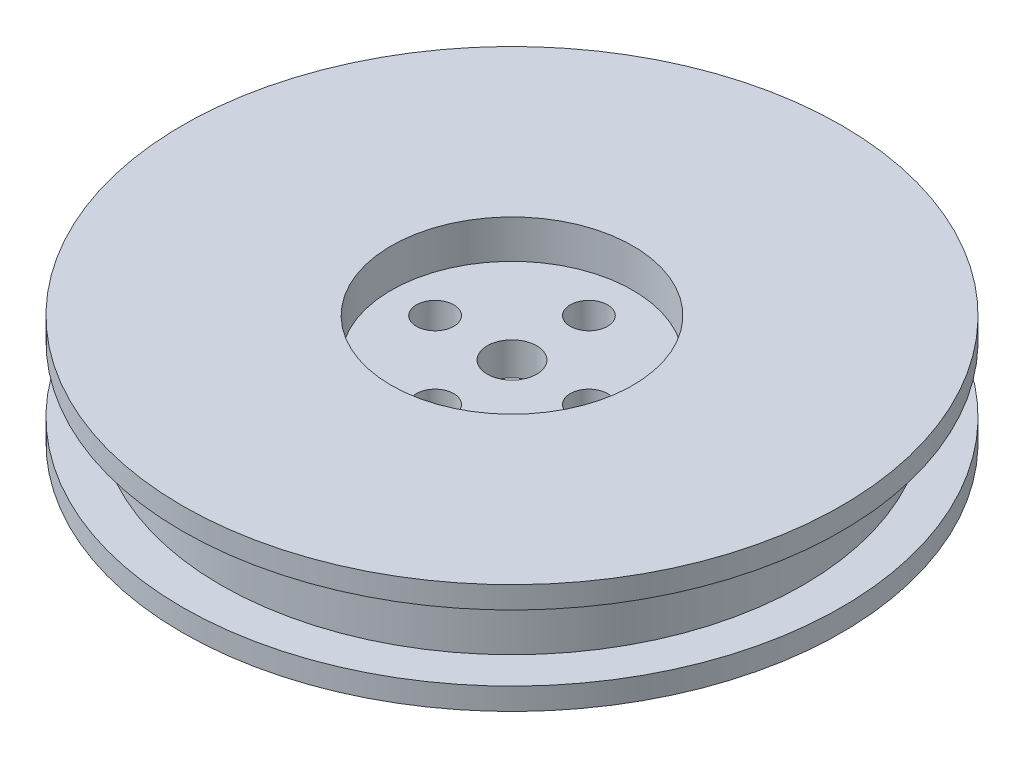
ISO-10303-21;
HEADER;
FILE_DESCRIPTION(('STEP AP214'),'2;1');
FILE_NAME('part.step','',(''),(''),'','','');
FILE_SCHEMA(('AUTOMOTIVE_DESIGN { 1 0 10303 214 1 1 1 1 }'));
ENDSEC;
DATA;
#1=APPLICATION_CONTEXT('core data for automotive mechanical design processes');
#2=APPLICATION_PROTOCOL_DEFINITION('international standard','automotive_design',2000,#1);
#3=PRODUCT_CONTEXT('',#1,'mechanical');
#4=PRODUCT('Part','Part','',(#3));
#5=PRODUCT_RELATED_PRODUCT_CATEGORY('part','',(#4));
#6=PRODUCT_DEFINITION_FORMATION('','',#4);
#7=PRODUCT_DEFINITION_CONTEXT('part definition',#1,'design');
#8=PRODUCT_DEFINITION('design','',#6,#7);
#9=PRODUCT_DEFINITION_SHAPE('','',#8);
#10=(LENGTH_UNIT() NAMED_UNIT(*) SI_UNIT(.MILLI.,.METRE.));
#11=(NAMED_UNIT(*) PLANE_ANGLE_UNIT() SI_UNIT($,.RADIAN.));
#12=(NAMED_UNIT(*) SI_UNIT($,.STERADIAN.) SOLID_ANGLE_UNIT());
#13=UNCERTAINTY_MEASURE_WITH_UNIT(LENGTH_MEASURE(1.E-05),#10,'distance_accuracy_value','');
#14=(GEOMETRIC_REPRESENTATION_CONTEXT(3) GLOBAL_UNCERTAINTY_ASSIGNED_CONTEXT((#13)) GLOBAL_UNIT_ASSIGNED_CONTEXT((#10,
#11,#12)) REPRESENTATION_CONTEXT('',''));
#15=CARTESIAN_POINT('',(0.,0.,0.));
#16=DIRECTION('',(0.,0.,1.));
#17=DIRECTION('',(1.,0.,0.));
#18=AXIS2_PLACEMENT_3D('',#15,#16,#17);
#19=CARTESIAN_POINT('',(0.,2.,0.));
#20=DIRECTION('',(0.,-1.,0.));
#21=DIRECTION('',(0.,0.,-1.));
#22=AXIS2_PLACEMENT_3D('',#19,#20,#21);
#23=CYLINDRICAL_SURFACE('',#22,30.);
#24=CARTESIAN_POINT('',(0.,2.,0.));
#25=DIRECTION('',(0.,1.,0.));
#26=DIRECTION('',(0.,0.,1.));
#27=AXIS2_PLACEMENT_3D('',#24,#25,#26);
#28=CIRCLE('',#27,30.);
#29=CARTESIAN_POINT('',(0.,2.,30.));
#30=VERTEX_POINT('',#29);
#31=EDGE_CURVE('E38',#30,#30,#28,.T.);
#32=ORIENTED_EDGE('',*,*,#31,.F.);
#33=EDGE_LOOP('',(#32));
#34=FACE_BOUND('',#33,.T.);
#35=CARTESIAN_POINT('',(0.,0.,0.));
#36=DIRECTION('',(0.,1.,0.));
#37=DIRECTION('',(0.,0.,1.));
#38=AXIS2_PLACEMENT_3D('',#35,#36,#37);
#39=CIRCLE('',#38,30.);
#40=CARTESIAN_POINT('',(0.,0.,30.));
#41=VERTEX_POINT('',#40);
#42=EDGE_CURVE('E43',#41,#41,#39,.T.);
#43=ORIENTED_EDGE('',*,*,#42,.T.);
#44=EDGE_LOOP('',(#43));
#45=FACE_BOUND('',#44,.T.);
#46=ADVANCED_FACE('F31',(#34,#45),#23,.T.);
#47=CARTESIAN_POINT('',(0.,2.,0.));
#48=DIRECTION('',(0.,1.,0.));
#49=DIRECTION('',(0.,0.,1.));
#50=AXIS2_PLACEMENT_3D('',#47,#48,#49);
#51=PLANE('',#50);
#52=CARTESIAN_POINT('',(0.,2.,0.));
#53=DIRECTION('',(0.,1.,0.));
#54=DIRECTION('',(0.,0.,1.));
#55=AXIS2_PLACEMENT_3D('',#52,#53,#54);
#56=CIRCLE('',#55,26.5);
#57=CARTESIAN_POINT('',(0.,2.,26.5));
#58=VERTEX_POINT('',#57);
#59=EDGE_CURVE('E10',#58,#58,#56,.T.);
#60=ORIENTED_EDGE('',*,*,#59,.F.);
#61=EDGE_LOOP('',(#60));
#62=FACE_BOUND('',#61,.T.);
#63=ORIENTED_EDGE('',*,*,#31,.T.);
#64=EDGE_LOOP('',(#63));
#65=FACE_BOUND('',#64,.T.);
#66=ADVANCED_FACE('F142',(#62,#65),#51,.T.);
#67=CARTESIAN_POINT('',(0.,0.,0.));
#68=DIRECTION('',(0.,1.,0.));
#69=DIRECTION('',(0.,0.,1.));
#70=AXIS2_PLACEMENT_3D('',#67,#68,#69);
#71=PLANE('',#70);
#72=CARTESIAN_POINT('',(0.,0.,0.));
#73=DIRECTION('',(0.,-1.,0.));
#74=DIRECTION('',(0.,0.,-1.));
#75=AXIS2_PLACEMENT_3D('',#72,#73,#74);
#76=CIRCLE('',#75,11.);
#77=CARTESIAN_POINT('',(0.,0.,-11.));
#78=VERTEX_POINT('',#77);
#79=EDGE_CURVE('E63',#78,#78,#76,.T.);
#80=ORIENTED_EDGE('',*,*,#79,.F.);
#81=EDGE_LOOP('',(#80));
#82=FACE_BOUND('',#81,.T.);
#83=ORIENTED_EDGE('',*,*,#42,.F.);
#84=EDGE_LOOP('',(#83));
#85=FACE_BOUND('',#84,.T.);
#86=ADVANCED_FACE('F147',(#82,#85),#71,.F.);
#87=CARTESIAN_POINT('',(0.,8.,0.));
#88=DIRECTION('',(0.,-1.,0.));
#89=DIRECTION('',(0.,0.,-1.));
#90=AXIS2_PLACEMENT_3D('',#87,#88,#89);
#91=CYLINDRICAL_SURFACE('',#90,26.5);
#92=CARTESIAN_POINT('',(0.,8.,0.));
#93=DIRECTION('',(0.,1.,0.));
#94=DIRECTION('',(0.,0.,1.));
#95=AXIS2_PLACEMENT_3D('',#92,#93,#94);
#96=CIRCLE('',#95,26.5);
#97=CARTESIAN_POINT('',(0.,8.,26.5));
#98=VERTEX_POINT('',#97);
#99=EDGE_CURVE('E46',#98,#98,#96,.T.);
#100=ORIENTED_EDGE('',*,*,#99,.F.);
#101=EDGE_LOOP('',(#100));
#102=FACE_BOUND('',#101,.T.);
#103=ORIENTED_EDGE('',*,*,#59,.T.);
#104=EDGE_LOOP('',(#103));
#105=FACE_BOUND('',#104,.T.);
#106=ADVANCED_FACE('F137',(#102,#105),#91,.T.);
#107=CARTESIAN_POINT('',(0.,10.,0.));
#108=DIRECTION('',(0.,-1.,0.));
#109=DIRECTION('',(0.,0.,-1.));
#110=AXIS2_PLACEMENT_3D('',#107,#108,#109);
#111=CYLINDRICAL_SURFACE('',#110,30.);
#112=CARTESIAN_POINT('',(0.,10.,0.));
#113=DIRECTION('',(0.,1.,0.));
#114=DIRECTION('',(0.,0.,1.));
#115=AXIS2_PLACEMENT_3D('',#112,#113,#114);
#116=CIRCLE('',#115,30.);
#117=CARTESIAN_POINT('',(0.,10.,30.));
#118=VERTEX_POINT('',#117);
#119=EDGE_CURVE('E52',#118,#118,#116,.T.);
#120=ORIENTED_EDGE('',*,*,#119,.F.);
#121=EDGE_LOOP('',(#120));
#122=FACE_BOUND('',#121,.T.);
#123=CARTESIAN_POINT('',(0.,8.,0.));
#124=DIRECTION('',(0.,1.,0.));
#125=DIRECTION('',(0.,0.,1.));
#126=AXIS2_PLACEMENT_3D('',#123,#124,#125);
#127=CIRCLE('',#126,30.);
#128=CARTESIAN_POINT('',(0.,8.,30.));
#129=VERTEX_POINT('',#128);
#130=EDGE_CURVE('E56',#129,#129,#127,.T.);
#131=ORIENTED_EDGE('',*,*,#130,.T.);
#132=EDGE_LOOP('',(#131));
#133=FACE_BOUND('',#132,.T.);
#134=ADVANCED_FACE('F129',(#122,#133),#111,.T.);
#135=CARTESIAN_POINT('',(0.,10.,0.));
#136=DIRECTION('',(0.,1.,0.));
#137=DIRECTION('',(0.,0.,1.));
#138=AXIS2_PLACEMENT_3D('',#135,#136,#137);
#139=PLANE('',#138);
#140=CARTESIAN_POINT('',(0.,10.,0.));
#141=DIRECTION('',(0.,1.,0.));
#142=DIRECTION('',(0.,0.,1.));
#143=AXIS2_PLACEMENT_3D('',#140,#141,#142);
#144=CIRCLE('',#143,11.);
#145=CARTESIAN_POINT('',(0.,10.,11.));
#146=VERTEX_POINT('',#145);
#147=EDGE_CURVE('E69',#146,#146,#144,.T.);
#148=ORIENTED_EDGE('',*,*,#147,.F.);
#149=EDGE_LOOP('',(#148));
#150=FACE_BOUND('',#149,.T.);
#151=ORIENTED_EDGE('',*,*,#119,.T.);
#152=EDGE_LOOP('',(#151));
#153=FACE_BOUND('',#152,.T.);
#154=ADVANCED_FACE('F126',(#150,#153),#139,.T.);
#155=CARTESIAN_POINT('',(0.,8.,0.));
#156=DIRECTION('',(0.,1.,0.));
#157=DIRECTION('',(0.,0.,1.));
#158=AXIS2_PLACEMENT_3D('',#155,#156,#157);
#159=PLANE('',#158);
#160=ORIENTED_EDGE('',*,*,#99,.T.);
#161=EDGE_LOOP('',(#160));
#162=FACE_BOUND('',#161,.T.);
#163=ORIENTED_EDGE('',*,*,#130,.F.);
#164=EDGE_LOOP('',(#163));
#165=FACE_BOUND('',#164,.T.);
#166=ADVANCED_FACE('F128',(#162,#165),#159,.F.);
#167=CARTESIAN_POINT('',(0.,3.5,0.));
#168=DIRECTION('',(0.,-1.,0.));
#169=DIRECTION('',(0.,0.,-1.));
#170=AXIS2_PLACEMENT_3D('',#167,#168,#169);
#171=CYLINDRICAL_SURFACE('',#170,11.);
#172=CARTESIAN_POINT('',(0.,3.5,0.));
#173=DIRECTION('',(0.,-1.,0.));
#174=DIRECTION('',(0.,0.,-1.));
#175=AXIS2_PLACEMENT_3D('',#172,#173,#174);
#176=CIRCLE('',#175,11.);
#177=CARTESIAN_POINT('',(0.,3.5,-11.));
#178=VERTEX_POINT('',#177);
#179=EDGE_CURVE('E61',#178,#178,#176,.T.);
#180=ORIENTED_EDGE('',*,*,#179,.F.);
#181=EDGE_LOOP('',(#180));
#182=FACE_BOUND('',#181,.T.);
#183=ORIENTED_EDGE('',*,*,#79,.T.);
#184=EDGE_LOOP('',(#183));
#185=FACE_BOUND('',#184,.T.);
#186=ADVANCED_FACE('F135',(#182,#185),#171,.F.);
#187=CARTESIAN_POINT('',(0.,3.5,0.));
#188=DIRECTION('',(0.,-1.,0.));
#189=DIRECTION('',(0.,0.,-1.));
#190=AXIS2_PLACEMENT_3D('',#187,#188,#189);
#191=PLANE('',#190);
#192=CARTESIAN_POINT('',(0.,3.5,-7.));
#193=DIRECTION('',(0.,-1.,0.));
#194=DIRECTION('',(0.,0.,-1.));
#195=AXIS2_PLACEMENT_3D('',#192,#193,#194);
#196=CIRCLE('',#195,1.7);
#197=CARTESIAN_POINT('',(0.,3.5,-8.7));
#198=VERTEX_POINT('',#197);
#199=EDGE_CURVE('E77',#198,#198,#196,.T.);
#200=ORIENTED_EDGE('',*,*,#199,.F.);
#201=EDGE_LOOP('',(#200));
#202=FACE_BOUND('',#201,.T.);
#203=CARTESIAN_POINT('',(7.0000000000002,3.5,-1.98094713253425E-13));
#204=DIRECTION('',(0.,-1.,0.));
#205=DIRECTION('',(0.,0.,-1.));
#206=AXIS2_PLACEMENT_3D('',#203,#204,#205);
#207=CIRCLE('',#206,1.70000000000015);
#208=CARTESIAN_POINT('',(7.0000000000002,3.5,-1.70000000000035));
#209=VERTEX_POINT('',#208);
#210=EDGE_CURVE('E80',#209,#209,#207,.T.);
#211=ORIENTED_EDGE('',*,*,#210,.F.);
#212=EDGE_LOOP('',(#211));
#213=FACE_BOUND('',#212,.T.);
#214=CARTESIAN_POINT('',(3.9618942650685E-13,3.5,7.));
#215=DIRECTION('',(0.,-1.,0.));
#216=DIRECTION('',(0.,0.,-1.));
#217=AXIS2_PLACEMENT_3D('',#214,#215,#216);
#218=CIRCLE('',#217,1.70000000000043);
#219=CARTESIAN_POINT('',(3.9618942650685E-13,3.5,5.29999999999958));
#220=VERTEX_POINT('',#219);
#221=EDGE_CURVE('E83',#220,#220,#218,.T.);
#222=ORIENTED_EDGE('',*,*,#221,.F.);
#223=EDGE_LOOP('',(#222));
#224=FACE_BOUND('',#223,.T.);
#225=CARTESIAN_POINT('',(-6.9999999999998,3.5,1.98951966012828E-13));
#226=DIRECTION('',(0.,-1.,0.));
#227=DIRECTION('',(0.,0.,-1.));
#228=AXIS2_PLACEMENT_3D('',#225,#226,#227);
#229=CIRCLE('',#228,1.70000000000032);
#230=CARTESIAN_POINT('',(-6.9999999999998,3.5,-1.70000000000012));
#231=VERTEX_POINT('',#230);
#232=EDGE_CURVE('E86',#231,#231,#229,.T.);
#233=ORIENTED_EDGE('',*,*,#232,.F.);
#234=EDGE_LOOP('',(#233));
#235=FACE_BOUND('',#234,.T.);
#236=CARTESIAN_POINT('',(0.,3.5,0.));
#237=DIRECTION('',(0.,-1.,0.));
#238=DIRECTION('',(0.,0.,-1.));
#239=AXIS2_PLACEMENT_3D('',#236,#237,#238);
#240=CIRCLE('',#239,2.25);
#241=CARTESIAN_POINT('',(0.,3.5,-2.25));
#242=VERTEX_POINT('',#241);
#243=EDGE_CURVE('E34',#242,#242,#240,.T.);
#244=ORIENTED_EDGE('',*,*,#243,.F.);
#245=EDGE_LOOP('',(#244));
#246=FACE_BOUND('',#245,.T.);
#247=ORIENTED_EDGE('',*,*,#179,.T.);
#248=EDGE_LOOP('',(#247));
#249=FACE_BOUND('',#248,.T.);
#250=ADVANCED_FACE('F122',(#202,#213,#224,#235,#246,#249),#191,.T.);
#251=CARTESIAN_POINT('',(0.,6.5,0.));
#252=DIRECTION('',(0.,1.,0.));
#253=DIRECTION('',(0.,0.,1.));
#254=AXIS2_PLACEMENT_3D('',#251,#252,#253);
#255=CYLINDRICAL_SURFACE('',#254,11.);
#256=CARTESIAN_POINT('',(0.,6.5,0.));
#257=DIRECTION('',(0.,1.,0.));
#258=DIRECTION('',(0.,0.,1.));
#259=AXIS2_PLACEMENT_3D('',#256,#257,#258);
#260=CIRCLE('',#259,11.);
#261=CARTESIAN_POINT('',(0.,6.5,11.));
#262=VERTEX_POINT('',#261);
#263=EDGE_CURVE('E66',#262,#262,#260,.T.);
#264=ORIENTED_EDGE('',*,*,#263,.F.);
#265=EDGE_LOOP('',(#264));
#266=FACE_BOUND('',#265,.T.);
#267=ORIENTED_EDGE('',*,*,#147,.T.);
#268=EDGE_LOOP('',(#267));
#269=FACE_BOUND('',#268,.T.);
#270=ADVANCED_FACE('F108',(#266,#269),#255,.F.);
#271=CARTESIAN_POINT('',(0.,6.5,0.));
#272=DIRECTION('',(0.,1.,0.));
#273=DIRECTION('',(0.,0.,1.));
#274=AXIS2_PLACEMENT_3D('',#271,#272,#273);
#275=PLANE('',#274);
#276=CARTESIAN_POINT('',(0.,6.5,-7.));
#277=DIRECTION('',(0.,1.,0.));
#278=DIRECTION('',(0.,0.,1.));
#279=AXIS2_PLACEMENT_3D('',#276,#277,#278);
#280=CIRCLE('',#279,1.7);
#281=CARTESIAN_POINT('',(0.,6.5,-5.3));
#282=VERTEX_POINT('',#281);
#283=EDGE_CURVE('E89',#282,#282,#280,.T.);
#284=ORIENTED_EDGE('',*,*,#283,.F.);
#285=EDGE_LOOP('',(#284));
#286=FACE_BOUND('',#285,.T.);
#287=CARTESIAN_POINT('',(7.0000000000002,6.5,-1.98094713253425E-13));
#288=DIRECTION('',(0.,1.,0.));
#289=DIRECTION('',(0.,0.,1.));
#290=AXIS2_PLACEMENT_3D('',#287,#288,#289);
#291=CIRCLE('',#290,1.70000000000015);
#292=CARTESIAN_POINT('',(7.0000000000002,6.5,1.69999999999996));
#293=VERTEX_POINT('',#292);
#294=EDGE_CURVE('E96',#293,#293,#291,.T.);
#295=ORIENTED_EDGE('',*,*,#294,.F.);
#296=EDGE_LOOP('',(#295));
#297=FACE_BOUND('',#296,.T.);
#298=CARTESIAN_POINT('',(3.9618942650685E-13,6.5,7.));
#299=DIRECTION('',(0.,1.,0.));
#300=DIRECTION('',(0.,0.,1.));
#301=AXIS2_PLACEMENT_3D('',#298,#299,#300);
#302=CIRCLE('',#301,1.70000000000043);
#303=CARTESIAN_POINT('',(3.9618942650685E-13,6.5,8.70000000000043));
#304=VERTEX_POINT('',#303);
#305=EDGE_CURVE('E93',#304,#304,#302,.T.);
#306=ORIENTED_EDGE('',*,*,#305,.F.);
#307=EDGE_LOOP('',(#306));
#308=FACE_BOUND('',#307,.T.);
#309=CARTESIAN_POINT('',(-6.9999999999998,6.5,1.98951966012828E-13));
#310=DIRECTION('',(0.,1.,0.));
#311=DIRECTION('',(0.,0.,1.));
#312=AXIS2_PLACEMENT_3D('',#309,#310,#311);
#313=CIRCLE('',#312,1.70000000000032);
#314=CARTESIAN_POINT('',(-6.9999999999998,6.5,1.70000000000052));
#315=VERTEX_POINT('',#314);
#316=EDGE_CURVE('E90',#315,#315,#313,.T.);
#317=ORIENTED_EDGE('',*,*,#316,.F.);
#318=EDGE_LOOP('',(#317));
#319=FACE_BOUND('',#318,.T.);
#320=CARTESIAN_POINT('',(0.,6.5,0.));
#321=DIRECTION('',(0.,1.,0.));
#322=DIRECTION('',(0.,0.,1.));
#323=AXIS2_PLACEMENT_3D('',#320,#321,#322);
#324=CIRCLE('',#323,2.25);
#325=CARTESIAN_POINT('',(0.,6.5,2.25));
#326=VERTEX_POINT('',#325);
#327=EDGE_CURVE('E74',#326,#326,#324,.T.);
#328=ORIENTED_EDGE('',*,*,#327,.F.);
#329=EDGE_LOOP('',(#328));
#330=FACE_BOUND('',#329,.T.);
#331=ORIENTED_EDGE('',*,*,#263,.T.);
#332=EDGE_LOOP('',(#331));
#333=FACE_BOUND('',#332,.T.);
#334=ADVANCED_FACE('F104',(#286,#297,#308,#319,#330,#333),#275,.T.);
#335=CARTESIAN_POINT('',(0.,-6.,0.));
#336=DIRECTION('',(0.,1.,0.));
#337=DIRECTION('',(0.,0.,1.));
#338=AXIS2_PLACEMENT_3D('',#335,#336,#337);
#339=CYLINDRICAL_SURFACE('',#338,2.25);
#340=ORIENTED_EDGE('',*,*,#243,.T.);
#341=EDGE_LOOP('',(#340));
#342=FACE_BOUND('',#341,.T.);
#343=ORIENTED_EDGE('',*,*,#327,.T.);
#344=EDGE_LOOP('',(#343));
#345=FACE_BOUND('',#344,.T.);
#346=ADVANCED_FACE('F107',(#342,#345),#339,.F.);
#347=CARTESIAN_POINT('',(-6.9999999999998,-3.5,1.98951966012828E-13));
#348=DIRECTION('',(0.,1.,0.));
#349=DIRECTION('',(0.,0.,1.));
#350=AXIS2_PLACEMENT_3D('',#347,#348,#349);
#351=CYLINDRICAL_SURFACE('',#350,1.70000000000032);
#352=ORIENTED_EDGE('',*,*,#232,.T.);
#353=EDGE_LOOP('',(#352));
#354=FACE_BOUND('',#353,.T.);
#355=ORIENTED_EDGE('',*,*,#316,.T.);
#356=EDGE_LOOP('',(#355));
#357=FACE_BOUND('',#356,.T.);
#358=ADVANCED_FACE('F208',(#354,#357),#351,.F.);
#359=CARTESIAN_POINT('',(3.9618942650685E-13,-3.5,7.));
#360=DIRECTION('',(0.,1.,0.));
#361=DIRECTION('',(0.,0.,1.));
#362=AXIS2_PLACEMENT_3D('',#359,#360,#361);
#363=CYLINDRICAL_SURFACE('',#362,1.70000000000043);
#364=ORIENTED_EDGE('',*,*,#221,.T.);
#365=EDGE_LOOP('',(#364));
#366=FACE_BOUND('',#365,.T.);
#367=ORIENTED_EDGE('',*,*,#305,.T.);
#368=EDGE_LOOP('',(#367));
#369=FACE_BOUND('',#368,.T.);
#370=ADVANCED_FACE('F230',(#366,#369),#363,.F.);
#371=CARTESIAN_POINT('',(7.0000000000002,-3.5,-1.98094713253425E-13));
#372=DIRECTION('',(0.,1.,0.));
#373=DIRECTION('',(0.,0.,1.));
#374=AXIS2_PLACEMENT_3D('',#371,#372,#373);
#375=CYLINDRICAL_SURFACE('',#374,1.70000000000015);
#376=ORIENTED_EDGE('',*,*,#210,.T.);
#377=EDGE_LOOP('',(#376));
#378=FACE_BOUND('',#377,.T.);
#379=ORIENTED_EDGE('',*,*,#294,.T.);
#380=EDGE_LOOP('',(#379));
#381=FACE_BOUND('',#380,.T.);
#382=ADVANCED_FACE('F240',(#378,#381),#375,.F.);
#383=CARTESIAN_POINT('',(0.,-3.5,-7.));
#384=DIRECTION('',(0.,1.,0.));
#385=DIRECTION('',(0.,0.,1.));
#386=AXIS2_PLACEMENT_3D('',#383,#384,#385);
#387=CYLINDRICAL_SURFACE('',#386,1.7);
#388=ORIENTED_EDGE('',*,*,#199,.T.);
#389=EDGE_LOOP('',(#388));
#390=FACE_BOUND('',#389,.T.);
#391=ORIENTED_EDGE('',*,*,#283,.T.);
#392=EDGE_LOOP('',(#391));
#393=FACE_BOUND('',#392,.T.);
#394=ADVANCED_FACE('F102',(#390,#393),#387,.F.);
#395=CLOSED_SHELL('',(#46,#66,#86,#106,#134,#154,#166,#186,#250,#270,#334,#346,#358,#370,#382,#394));
#396=MANIFOLD_SOLID_BREP('B2',#395);
#397=ADVANCED_BREP_SHAPE_REPRESENTATION('',(#18,#396),#14);
#398=SHAPE_DEFINITION_REPRESENTATION(#9,#397);
ENDSEC;
END-ISO-10303-21;
